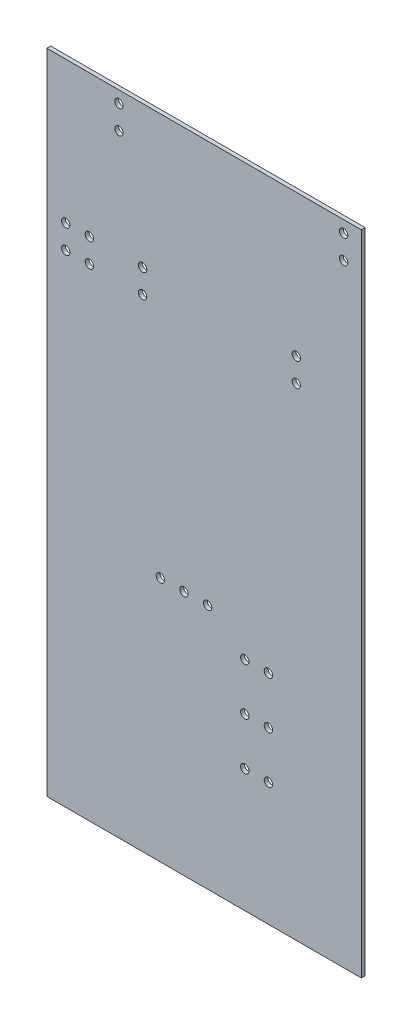
ISO-10303-21;
HEADER;
FILE_DESCRIPTION(('STEP AP214'),'2;1');
FILE_NAME('part.step','',(''),(''),'','','');
FILE_SCHEMA(('AUTOMOTIVE_DESIGN { 1 0 10303 214 1 1 1 1 }'));
ENDSEC;
DATA;
#1=APPLICATION_CONTEXT('core data for automotive mechanical design processes');
#2=APPLICATION_PROTOCOL_DEFINITION('international standard','automotive_design',2000,#1);
#3=PRODUCT_CONTEXT('',#1,'mechanical');
#4=PRODUCT('Part','Part','',(#3));
#5=PRODUCT_RELATED_PRODUCT_CATEGORY('part','',(#4));
#6=PRODUCT_DEFINITION_FORMATION('','',#4);
#7=PRODUCT_DEFINITION_CONTEXT('part definition',#1,'design');
#8=PRODUCT_DEFINITION('design','',#6,#7);
#9=PRODUCT_DEFINITION_SHAPE('','',#8);
#10=(LENGTH_UNIT() NAMED_UNIT(*) SI_UNIT(.MILLI.,.METRE.));
#11=(NAMED_UNIT(*) PLANE_ANGLE_UNIT() SI_UNIT($,.RADIAN.));
#12=(NAMED_UNIT(*) SI_UNIT($,.STERADIAN.) SOLID_ANGLE_UNIT());
#13=UNCERTAINTY_MEASURE_WITH_UNIT(LENGTH_MEASURE(1.E-05),#10,'distance_accuracy_value','');
#14=(GEOMETRIC_REPRESENTATION_CONTEXT(3) GLOBAL_UNCERTAINTY_ASSIGNED_CONTEXT((#13)) GLOBAL_UNIT_ASSIGNED_CONTEXT((#10,
#11,#12)) REPRESENTATION_CONTEXT('',''));
#15=CARTESIAN_POINT('',(0.,0.,0.));
#16=DIRECTION('',(0.,0.,1.));
#17=DIRECTION('',(1.,0.,0.));
#18=AXIS2_PLACEMENT_3D('',#15,#16,#17);
#19=CARTESIAN_POINT('',(114.807998657227,44.7039985656738,0.));
#20=DIRECTION('',(-1.,0.,0.));
#21=DIRECTION('',(0.,1.,0.));
#22=AXIS2_PLACEMENT_3D('',#19,#20,#21);
#23=PLANE('',#22);
#24=DIRECTION('',(0.,0.,1.));
#25=VECTOR('',#24,1.);
#26=CARTESIAN_POINT('',(114.807998657227,44.7039985656738,0.));
#27=LINE('',#26,#25);
#28=CARTESIAN_POINT('',(114.807998657227,44.7039985656738,0.));
#29=VERTEX_POINT('',#28);
#30=CARTESIAN_POINT('',(114.807998657227,44.7039985656738,0.41148));
#31=VERTEX_POINT('',#30);
#32=EDGE_CURVE('E11',#29,#31,#27,.T.);
#33=ORIENTED_EDGE('',*,*,#32,.T.);
#34=DIRECTION('',(0.,1.,0.));
#35=VECTOR('',#34,1.);
#36=CARTESIAN_POINT('',(114.807998657227,44.7039985656738,0.41148));
#37=LINE('',#36,#35);
#38=CARTESIAN_POINT('',(114.807998657227,114.300003051758,0.41148));
#39=VERTEX_POINT('',#38);
#40=EDGE_CURVE('E24',#31,#39,#37,.T.);
#41=ORIENTED_EDGE('',*,*,#40,.T.);
#42=DIRECTION('',(0.,0.,1.));
#43=VECTOR('',#42,1.);
#44=CARTESIAN_POINT('',(114.807998657227,114.300003051758,0.));
#45=LINE('',#44,#43);
#46=CARTESIAN_POINT('',(114.807998657227,114.300003051758,0.));
#47=VERTEX_POINT('',#46);
#48=EDGE_CURVE('E368',#47,#39,#45,.T.);
#49=ORIENTED_EDGE('',*,*,#48,.F.);
#50=DIRECTION('',(0.,1.,0.));
#51=VECTOR('',#50,1.);
#52=CARTESIAN_POINT('',(114.807998657227,44.7039985656738,0.));
#53=LINE('',#52,#51);
#54=EDGE_CURVE('E365',#29,#47,#53,.T.);
#55=ORIENTED_EDGE('',*,*,#54,.F.);
#56=EDGE_LOOP('',(#33,#41,#49,#55));
#57=FACE_BOUND('',#56,.T.);
#58=ADVANCED_FACE('F17',(#57),#23,.T.);
#59=CARTESIAN_POINT('',(114.807998657227,114.300003051758,0.));
#60=DIRECTION('',(0.,1.,0.));
#61=DIRECTION('',(1.,0.,0.));
#62=AXIS2_PLACEMENT_3D('',#59,#60,#61);
#63=PLANE('',#62);
#64=ORIENTED_EDGE('',*,*,#48,.T.);
#65=DIRECTION('',(1.,0.,0.));
#66=VECTOR('',#65,1.);
#67=CARTESIAN_POINT('',(114.807998657227,114.300003051758,0.41148));
#68=LINE('',#67,#66);
#69=CARTESIAN_POINT('',(148.589996337891,114.300003051758,0.41148));
#70=VERTEX_POINT('',#69);
#71=EDGE_CURVE('E362',#39,#70,#68,.T.);
#72=ORIENTED_EDGE('',*,*,#71,.T.);
#73=DIRECTION('',(0.,0.,1.));
#74=VECTOR('',#73,1.);
#75=CARTESIAN_POINT('',(148.589996337891,114.300003051758,0.));
#76=LINE('',#75,#74);
#77=CARTESIAN_POINT('',(148.589996337891,114.300003051758,0.));
#78=VERTEX_POINT('',#77);
#79=EDGE_CURVE('E360',#78,#70,#76,.T.);
#80=ORIENTED_EDGE('',*,*,#79,.F.);
#81=DIRECTION('',(1.,0.,0.));
#82=VECTOR('',#81,1.);
#83=CARTESIAN_POINT('',(114.807998657227,114.300003051758,0.));
#84=LINE('',#83,#82);
#85=EDGE_CURVE('E357',#47,#78,#84,.T.);
#86=ORIENTED_EDGE('',*,*,#85,.F.);
#87=EDGE_LOOP('',(#64,#72,#80,#86));
#88=FACE_BOUND('',#87,.T.);
#89=ADVANCED_FACE('F376',(#88),#63,.T.);
#90=CARTESIAN_POINT('',(148.589996337891,114.300003051758,0.));
#91=DIRECTION('',(1.,0.,0.));
#92=DIRECTION('',(0.,-1.,0.));
#93=AXIS2_PLACEMENT_3D('',#90,#91,#92);
#94=PLANE('',#93);
#95=ORIENTED_EDGE('',*,*,#79,.T.);
#96=DIRECTION('',(0.,-1.,0.));
#97=VECTOR('',#96,1.);
#98=CARTESIAN_POINT('',(148.589996337891,114.300003051758,0.41148));
#99=LINE('',#98,#97);
#100=CARTESIAN_POINT('',(148.589996337891,44.7039985656738,0.41148));
#101=VERTEX_POINT('',#100);
#102=EDGE_CURVE('E355',#70,#101,#99,.T.);
#103=ORIENTED_EDGE('',*,*,#102,.T.);
#104=DIRECTION('',(0.,0.,1.));
#105=VECTOR('',#104,1.);
#106=CARTESIAN_POINT('',(148.589996337891,44.7039985656738,0.));
#107=LINE('',#106,#105);
#108=CARTESIAN_POINT('',(148.589996337891,44.7039985656738,0.));
#109=VERTEX_POINT('',#108);
#110=EDGE_CURVE('E352',#109,#101,#107,.T.);
#111=ORIENTED_EDGE('',*,*,#110,.F.);
#112=DIRECTION('',(0.,-1.,0.));
#113=VECTOR('',#112,1.);
#114=CARTESIAN_POINT('',(148.589996337891,114.300003051758,0.));
#115=LINE('',#114,#113);
#116=EDGE_CURVE('E349',#78,#109,#115,.T.);
#117=ORIENTED_EDGE('',*,*,#116,.F.);
#118=EDGE_LOOP('',(#95,#103,#111,#117));
#119=FACE_BOUND('',#118,.T.);
#120=ADVANCED_FACE('F383',(#119),#94,.T.);
#121=CARTESIAN_POINT('',(148.589996337891,44.7039985656738,0.));
#122=DIRECTION('',(0.,-1.,0.));
#123=DIRECTION('',(-1.,0.,0.));
#124=AXIS2_PLACEMENT_3D('',#121,#122,#123);
#125=PLANE('',#124);
#126=ORIENTED_EDGE('',*,*,#110,.T.);
#127=DIRECTION('',(-1.,0.,0.));
#128=VECTOR('',#127,1.);
#129=CARTESIAN_POINT('',(148.589996337891,44.7039985656738,0.41148));
#130=LINE('',#129,#128);
#131=EDGE_CURVE('E347',#101,#31,#130,.T.);
#132=ORIENTED_EDGE('',*,*,#131,.T.);
#133=ORIENTED_EDGE('',*,*,#32,.F.);
#134=DIRECTION('',(-1.,0.,0.));
#135=VECTOR('',#134,1.);
#136=CARTESIAN_POINT('',(148.589996337891,44.7039985656738,0.));
#137=LINE('',#136,#135);
#138=EDGE_CURVE('E344',#109,#29,#137,.T.);
#139=ORIENTED_EDGE('',*,*,#138,.F.);
#140=EDGE_LOOP('',(#126,#132,#133,#139));
#141=FACE_BOUND('',#140,.T.);
#142=ADVANCED_FACE('F384',(#141),#125,.T.);
#143=CARTESIAN_POINT('',(119.38,96.52,0.));
#144=DIRECTION('',(0.,0.,-1.));
#145=DIRECTION('',(1.,0.,0.));
#146=AXIS2_PLACEMENT_3D('',#143,#144,#145);
#147=CYLINDRICAL_SURFACE('',#146,0.4499991);
#148=DIRECTION('',(0.,0.,1.));
#149=VECTOR('',#148,1.);
#150=CARTESIAN_POINT('',(119.8299991,96.52,0.));
#151=LINE('',#150,#149);
#152=CARTESIAN_POINT('',(119.8299991,96.52,0.));
#153=VERTEX_POINT('',#152);
#154=CARTESIAN_POINT('',(119.8299991,96.52,0.41148));
#155=VERTEX_POINT('',#154);
#156=EDGE_CURVE('E342',#153,#155,#151,.T.);
#157=ORIENTED_EDGE('',*,*,#156,.T.);
#158=CARTESIAN_POINT('',(119.38,96.52,0.41148));
#159=DIRECTION('',(0.,0.,1.));
#160=DIRECTION('',(1.,0.,0.));
#161=AXIS2_PLACEMENT_3D('',#158,#159,#160);
#162=CIRCLE('',#161,0.4499991);
#163=EDGE_CURVE('E339',#155,#155,#162,.T.);
#164=ORIENTED_EDGE('',*,*,#163,.T.);
#165=ORIENTED_EDGE('',*,*,#156,.F.);
#166=CARTESIAN_POINT('',(119.38,96.52,0.));
#167=DIRECTION('',(0.,0.,1.));
#168=DIRECTION('',(1.,0.,0.));
#169=AXIS2_PLACEMENT_3D('',#166,#167,#168);
#170=CIRCLE('',#169,0.4499991);
#171=EDGE_CURVE('E337',#153,#153,#170,.T.);
#172=ORIENTED_EDGE('',*,*,#171,.F.);
#173=EDGE_LOOP('',(#157,#164,#165,#172));
#174=FACE_BOUND('',#173,.T.);
#175=ADVANCED_FACE('F386',(#174),#147,.F.);
#176=CARTESIAN_POINT('',(116.84,99.06,0.));
#177=DIRECTION('',(0.,0.,-1.));
#178=DIRECTION('',(1.,0.,0.));
#179=AXIS2_PLACEMENT_3D('',#176,#177,#178);
#180=CYLINDRICAL_SURFACE('',#179,0.4499991);
#181=DIRECTION('',(0.,0.,1.));
#182=VECTOR('',#181,1.);
#183=CARTESIAN_POINT('',(117.2899991,99.06,0.));
#184=LINE('',#183,#182);
#185=CARTESIAN_POINT('',(117.2899991,99.06,0.));
#186=VERTEX_POINT('',#185);
#187=CARTESIAN_POINT('',(117.2899991,99.06,0.41148));
#188=VERTEX_POINT('',#187);
#189=EDGE_CURVE('E335',#186,#188,#184,.T.);
#190=ORIENTED_EDGE('',*,*,#189,.T.);
#191=CARTESIAN_POINT('',(116.84,99.06,0.41148));
#192=DIRECTION('',(0.,0.,1.));
#193=DIRECTION('',(1.,0.,0.));
#194=AXIS2_PLACEMENT_3D('',#191,#192,#193);
#195=CIRCLE('',#194,0.4499991);
#196=EDGE_CURVE('E332',#188,#188,#195,.T.);
#197=ORIENTED_EDGE('',*,*,#196,.T.);
#198=ORIENTED_EDGE('',*,*,#189,.F.);
#199=CARTESIAN_POINT('',(116.84,99.06,0.));
#200=DIRECTION('',(0.,0.,1.));
#201=DIRECTION('',(1.,0.,0.));
#202=AXIS2_PLACEMENT_3D('',#199,#200,#201);
#203=CIRCLE('',#202,0.4499991);
#204=EDGE_CURVE('E329',#186,#186,#203,.T.);
#205=ORIENTED_EDGE('',*,*,#204,.F.);
#206=EDGE_LOOP('',(#190,#197,#198,#205));
#207=FACE_BOUND('',#206,.T.);
#208=ADVANCED_FACE('F393',(#207),#180,.F.);
#209=CARTESIAN_POINT('',(116.84,96.52,0.));
#210=DIRECTION('',(0.,0.,-1.));
#211=DIRECTION('',(1.,0.,0.));
#212=AXIS2_PLACEMENT_3D('',#209,#210,#211);
#213=CYLINDRICAL_SURFACE('',#212,0.4499991);
#214=DIRECTION('',(0.,0.,1.));
#215=VECTOR('',#214,1.);
#216=CARTESIAN_POINT('',(117.2899991,96.52,0.));
#217=LINE('',#216,#215);
#218=CARTESIAN_POINT('',(117.2899991,96.52,0.));
#219=VERTEX_POINT('',#218);
#220=CARTESIAN_POINT('',(117.2899991,96.52,0.41148));
#221=VERTEX_POINT('',#220);
#222=EDGE_CURVE('E327',#219,#221,#217,.T.);
#223=ORIENTED_EDGE('',*,*,#222,.T.);
#224=CARTESIAN_POINT('',(116.84,96.52,0.41148));
#225=DIRECTION('',(0.,0.,1.));
#226=DIRECTION('',(1.,0.,0.));
#227=AXIS2_PLACEMENT_3D('',#224,#225,#226);
#228=CIRCLE('',#227,0.4499991);
#229=EDGE_CURVE('E324',#221,#221,#228,.T.);
#230=ORIENTED_EDGE('',*,*,#229,.T.);
#231=ORIENTED_EDGE('',*,*,#222,.F.);
#232=CARTESIAN_POINT('',(116.84,96.52,0.));
#233=DIRECTION('',(0.,0.,1.));
#234=DIRECTION('',(1.,0.,0.));
#235=AXIS2_PLACEMENT_3D('',#232,#233,#234);
#236=CIRCLE('',#235,0.4499991);
#237=EDGE_CURVE('E321',#219,#219,#236,.T.);
#238=ORIENTED_EDGE('',*,*,#237,.F.);
#239=EDGE_LOOP('',(#223,#230,#231,#238));
#240=FACE_BOUND('',#239,.T.);
#241=ADVANCED_FACE('F431',(#240),#213,.F.);
#242=CARTESIAN_POINT('',(119.38,99.06,0.));
#243=DIRECTION('',(0.,0.,-1.));
#244=DIRECTION('',(1.,0.,0.));
#245=AXIS2_PLACEMENT_3D('',#242,#243,#244);
#246=CYLINDRICAL_SURFACE('',#245,0.4499991);
#247=DIRECTION('',(0.,0.,1.));
#248=VECTOR('',#247,1.);
#249=CARTESIAN_POINT('',(119.8299991,99.06,0.));
#250=LINE('',#249,#248);
#251=CARTESIAN_POINT('',(119.8299991,99.06,0.));
#252=VERTEX_POINT('',#251);
#253=CARTESIAN_POINT('',(119.8299991,99.06,0.41148));
#254=VERTEX_POINT('',#253);
#255=EDGE_CURVE('E319',#252,#254,#250,.T.);
#256=ORIENTED_EDGE('',*,*,#255,.T.);
#257=CARTESIAN_POINT('',(119.38,99.06,0.41148));
#258=DIRECTION('',(0.,0.,1.));
#259=DIRECTION('',(1.,0.,0.));
#260=AXIS2_PLACEMENT_3D('',#257,#258,#259);
#261=CIRCLE('',#260,0.4499991);
#262=EDGE_CURVE('E316',#254,#254,#261,.T.);
#263=ORIENTED_EDGE('',*,*,#262,.T.);
#264=ORIENTED_EDGE('',*,*,#255,.F.);
#265=CARTESIAN_POINT('',(119.38,99.06,0.));
#266=DIRECTION('',(0.,0.,1.));
#267=DIRECTION('',(1.,0.,0.));
#268=AXIS2_PLACEMENT_3D('',#265,#266,#267);
#269=CIRCLE('',#268,0.4499991);
#270=EDGE_CURVE('E314',#252,#252,#269,.T.);
#271=ORIENTED_EDGE('',*,*,#270,.F.);
#272=EDGE_LOOP('',(#256,#263,#264,#271));
#273=FACE_BOUND('',#272,.T.);
#274=ADVANCED_FACE('F441',(#273),#246,.F.);
#275=CARTESIAN_POINT('',(125.095,96.52,0.));
#276=DIRECTION('',(0.,0.,-1.));
#277=DIRECTION('',(1.,0.,0.));
#278=AXIS2_PLACEMENT_3D('',#275,#276,#277);
#279=CYLINDRICAL_SURFACE('',#278,0.4499991);
#280=DIRECTION('',(0.,0.,1.));
#281=VECTOR('',#280,1.);
#282=CARTESIAN_POINT('',(125.5449991,96.52,0.));
#283=LINE('',#282,#281);
#284=CARTESIAN_POINT('',(125.5449991,96.52,0.));
#285=VERTEX_POINT('',#284);
#286=CARTESIAN_POINT('',(125.5449991,96.52,0.41148));
#287=VERTEX_POINT('',#286);
#288=EDGE_CURVE('E312',#285,#287,#283,.T.);
#289=ORIENTED_EDGE('',*,*,#288,.T.);
#290=CARTESIAN_POINT('',(125.095,96.52,0.41148));
#291=DIRECTION('',(0.,0.,1.));
#292=DIRECTION('',(1.,0.,0.));
#293=AXIS2_PLACEMENT_3D('',#290,#291,#292);
#294=CIRCLE('',#293,0.4499991);
#295=EDGE_CURVE('E309',#287,#287,#294,.T.);
#296=ORIENTED_EDGE('',*,*,#295,.T.);
#297=ORIENTED_EDGE('',*,*,#288,.F.);
#298=CARTESIAN_POINT('',(125.095,96.52,0.));
#299=DIRECTION('',(0.,0.,1.));
#300=DIRECTION('',(1.,0.,0.));
#301=AXIS2_PLACEMENT_3D('',#298,#299,#300);
#302=CIRCLE('',#301,0.4499991);
#303=EDGE_CURVE('E307',#285,#285,#302,.T.);
#304=ORIENTED_EDGE('',*,*,#303,.F.);
#305=EDGE_LOOP('',(#289,#296,#297,#304));
#306=FACE_BOUND('',#305,.T.);
#307=ADVANCED_FACE('F451',(#306),#279,.F.);
#308=CARTESIAN_POINT('',(122.555,113.03,0.));
#309=DIRECTION('',(0.,0.,-1.));
#310=DIRECTION('',(1.,0.,0.));
#311=AXIS2_PLACEMENT_3D('',#308,#309,#310);
#312=CYLINDRICAL_SURFACE('',#311,0.4499991);
#313=DIRECTION('',(0.,0.,1.));
#314=VECTOR('',#313,1.);
#315=CARTESIAN_POINT('',(123.0049991,113.03,0.));
#316=LINE('',#315,#314);
#317=CARTESIAN_POINT('',(123.0049991,113.03,0.));
#318=VERTEX_POINT('',#317);
#319=CARTESIAN_POINT('',(123.0049991,113.03,0.41148));
#320=VERTEX_POINT('',#319);
#321=EDGE_CURVE('E305',#318,#320,#316,.T.);
#322=ORIENTED_EDGE('',*,*,#321,.T.);
#323=CARTESIAN_POINT('',(122.555,113.03,0.41148));
#324=DIRECTION('',(0.,0.,1.));
#325=DIRECTION('',(1.,0.,0.));
#326=AXIS2_PLACEMENT_3D('',#323,#324,#325);
#327=CIRCLE('',#326,0.4499991);
#328=EDGE_CURVE('E302',#320,#320,#327,.T.);
#329=ORIENTED_EDGE('',*,*,#328,.T.);
#330=ORIENTED_EDGE('',*,*,#321,.F.);
#331=CARTESIAN_POINT('',(122.555,113.03,0.));
#332=DIRECTION('',(0.,0.,1.));
#333=DIRECTION('',(1.,0.,0.));
#334=AXIS2_PLACEMENT_3D('',#331,#332,#333);
#335=CIRCLE('',#334,0.4499991);
#336=EDGE_CURVE('E299',#318,#318,#335,.T.);
#337=ORIENTED_EDGE('',*,*,#336,.F.);
#338=EDGE_LOOP('',(#322,#329,#330,#337));
#339=FACE_BOUND('',#338,.T.);
#340=ADVANCED_FACE('F461',(#339),#312,.F.);
#341=CARTESIAN_POINT('',(122.555,110.49,0.));
#342=DIRECTION('',(0.,0.,-1.));
#343=DIRECTION('',(1.,0.,0.));
#344=AXIS2_PLACEMENT_3D('',#341,#342,#343);
#345=CYLINDRICAL_SURFACE('',#344,0.4499991);
#346=DIRECTION('',(0.,0.,1.));
#347=VECTOR('',#346,1.);
#348=CARTESIAN_POINT('',(123.0049991,110.49,0.));
#349=LINE('',#348,#347);
#350=CARTESIAN_POINT('',(123.0049991,110.49,0.));
#351=VERTEX_POINT('',#350);
#352=CARTESIAN_POINT('',(123.0049991,110.49,0.41148));
#353=VERTEX_POINT('',#352);
#354=EDGE_CURVE('E296',#351,#353,#349,.T.);
#355=ORIENTED_EDGE('',*,*,#354,.T.);
#356=CARTESIAN_POINT('',(122.555,110.49,0.41148));
#357=DIRECTION('',(0.,0.,1.));
#358=DIRECTION('',(1.,0.,0.));
#359=AXIS2_PLACEMENT_3D('',#356,#357,#358);
#360=CIRCLE('',#359,0.4499991);
#361=EDGE_CURVE('E294',#353,#353,#360,.T.);
#362=ORIENTED_EDGE('',*,*,#361,.T.);
#363=ORIENTED_EDGE('',*,*,#354,.F.);
#364=CARTESIAN_POINT('',(122.555,110.49,0.));
#365=DIRECTION('',(0.,0.,1.));
#366=DIRECTION('',(1.,0.,0.));
#367=AXIS2_PLACEMENT_3D('',#364,#365,#366);
#368=CIRCLE('',#367,0.4499991);
#369=EDGE_CURVE('E291',#351,#351,#368,.T.);
#370=ORIENTED_EDGE('',*,*,#369,.F.);
#371=EDGE_LOOP('',(#355,#362,#363,#370));
#372=FACE_BOUND('',#371,.T.);
#373=ADVANCED_FACE('F471',(#372),#345,.F.);
#374=CARTESIAN_POINT('',(136.0678,57.912,0.));
#375=DIRECTION('',(0.,0.,-1.));
#376=DIRECTION('',(1.,0.,0.));
#377=AXIS2_PLACEMENT_3D('',#374,#375,#376);
#378=CYLINDRICAL_SURFACE('',#377,0.4499991);
#379=DIRECTION('',(0.,0.,1.));
#380=VECTOR('',#379,1.);
#381=CARTESIAN_POINT('',(136.5177991,57.912,0.));
#382=LINE('',#381,#380);
#383=CARTESIAN_POINT('',(136.5177991,57.912,0.));
#384=VERTEX_POINT('',#383);
#385=CARTESIAN_POINT('',(136.5177991,57.912,0.41148));
#386=VERTEX_POINT('',#385);
#387=EDGE_CURVE('E289',#384,#386,#382,.T.);
#388=ORIENTED_EDGE('',*,*,#387,.T.);
#389=CARTESIAN_POINT('',(136.0678,57.912,0.41148));
#390=DIRECTION('',(0.,0.,1.));
#391=DIRECTION('',(1.,0.,0.));
#392=AXIS2_PLACEMENT_3D('',#389,#390,#391);
#393=CIRCLE('',#392,0.4499991);
#394=EDGE_CURVE('E286',#386,#386,#393,.T.);
#395=ORIENTED_EDGE('',*,*,#394,.T.);
#396=ORIENTED_EDGE('',*,*,#387,.F.);
#397=CARTESIAN_POINT('',(136.0678,57.912,0.));
#398=DIRECTION('',(0.,0.,1.));
#399=DIRECTION('',(1.,0.,0.));
#400=AXIS2_PLACEMENT_3D('',#397,#398,#399);
#401=CIRCLE('',#400,0.4499991);
#402=EDGE_CURVE('E283',#384,#384,#401,.T.);
#403=ORIENTED_EDGE('',*,*,#402,.F.);
#404=EDGE_LOOP('',(#388,#395,#396,#403));
#405=FACE_BOUND('',#404,.T.);
#406=ADVANCED_FACE('F481',(#405),#378,.F.);
#407=CARTESIAN_POINT('',(129.54,71.12,0.));
#408=DIRECTION('',(0.,0.,-1.));
#409=DIRECTION('',(1.,0.,0.));
#410=AXIS2_PLACEMENT_3D('',#407,#408,#409);
#411=CYLINDRICAL_SURFACE('',#410,0.4499991);
#412=DIRECTION('',(0.,0.,1.));
#413=VECTOR('',#412,1.);
#414=CARTESIAN_POINT('',(129.9899991,71.12,0.));
#415=LINE('',#414,#413);
#416=CARTESIAN_POINT('',(129.9899991,71.12,0.));
#417=VERTEX_POINT('',#416);
#418=CARTESIAN_POINT('',(129.9899991,71.12,0.41148));
#419=VERTEX_POINT('',#418);
#420=EDGE_CURVE('E280',#417,#419,#415,.T.);
#421=ORIENTED_EDGE('',*,*,#420,.T.);
#422=CARTESIAN_POINT('',(129.54,71.12,0.41148));
#423=DIRECTION('',(0.,0.,1.));
#424=DIRECTION('',(1.,0.,0.));
#425=AXIS2_PLACEMENT_3D('',#422,#423,#424);
#426=CIRCLE('',#425,0.4499991);
#427=EDGE_CURVE('E278',#419,#419,#426,.T.);
#428=ORIENTED_EDGE('',*,*,#427,.T.);
#429=ORIENTED_EDGE('',*,*,#420,.F.);
#430=CARTESIAN_POINT('',(129.54,71.12,0.));
#431=DIRECTION('',(0.,0.,1.));
#432=DIRECTION('',(1.,0.,0.));
#433=AXIS2_PLACEMENT_3D('',#430,#431,#432);
#434=CIRCLE('',#433,0.4499991);
#435=EDGE_CURVE('E276',#417,#417,#434,.T.);
#436=ORIENTED_EDGE('',*,*,#435,.F.);
#437=EDGE_LOOP('',(#421,#428,#429,#436));
#438=FACE_BOUND('',#437,.T.);
#439=ADVANCED_FACE('F491',(#438),#411,.F.);
#440=CARTESIAN_POINT('',(136.0678,62.992,0.));
#441=DIRECTION('',(0.,0.,-1.));
#442=DIRECTION('',(1.,0.,0.));
#443=AXIS2_PLACEMENT_3D('',#440,#441,#442);
#444=CYLINDRICAL_SURFACE('',#443,0.4499991);
#445=DIRECTION('',(0.,0.,1.));
#446=VECTOR('',#445,1.);
#447=CARTESIAN_POINT('',(136.5177991,62.992,0.));
#448=LINE('',#447,#446);
#449=CARTESIAN_POINT('',(136.5177991,62.992,0.));
#450=VERTEX_POINT('',#449);
#451=CARTESIAN_POINT('',(136.5177991,62.992,0.41148));
#452=VERTEX_POINT('',#451);
#453=EDGE_CURVE('E274',#450,#452,#448,.T.);
#454=ORIENTED_EDGE('',*,*,#453,.T.);
#455=CARTESIAN_POINT('',(136.0678,62.992,0.41148));
#456=DIRECTION('',(0.,0.,1.));
#457=DIRECTION('',(1.,0.,0.));
#458=AXIS2_PLACEMENT_3D('',#455,#456,#457);
#459=CIRCLE('',#458,0.4499991);
#460=EDGE_CURVE('E271',#452,#452,#459,.T.);
#461=ORIENTED_EDGE('',*,*,#460,.T.);
#462=ORIENTED_EDGE('',*,*,#453,.F.);
#463=CARTESIAN_POINT('',(136.0678,62.992,0.));
#464=DIRECTION('',(0.,0.,1.));
#465=DIRECTION('',(1.,0.,0.));
#466=AXIS2_PLACEMENT_3D('',#463,#464,#465);
#467=CIRCLE('',#466,0.4499991);
#468=EDGE_CURVE('E268',#450,#450,#467,.T.);
#469=ORIENTED_EDGE('',*,*,#468,.F.);
#470=EDGE_LOOP('',(#454,#461,#462,#469));
#471=FACE_BOUND('',#470,.T.);
#472=ADVANCED_FACE('F501',(#471),#444,.F.);
#473=CARTESIAN_POINT('',(138.6078,62.992,0.));
#474=DIRECTION('',(0.,0.,-1.));
#475=DIRECTION('',(1.,0.,0.));
#476=AXIS2_PLACEMENT_3D('',#473,#474,#475);
#477=CYLINDRICAL_SURFACE('',#476,0.4499991);
#478=DIRECTION('',(0.,0.,1.));
#479=VECTOR('',#478,1.);
#480=CARTESIAN_POINT('',(139.0577991,62.992,0.));
#481=LINE('',#480,#479);
#482=CARTESIAN_POINT('',(139.0577991,62.992,0.));
#483=VERTEX_POINT('',#482);
#484=CARTESIAN_POINT('',(139.0577991,62.992,0.41148));
#485=VERTEX_POINT('',#484);
#486=EDGE_CURVE('E266',#483,#485,#481,.T.);
#487=ORIENTED_EDGE('',*,*,#486,.T.);
#488=CARTESIAN_POINT('',(138.6078,62.992,0.41148));
#489=DIRECTION('',(0.,0.,1.));
#490=DIRECTION('',(1.,0.,0.));
#491=AXIS2_PLACEMENT_3D('',#488,#489,#490);
#492=CIRCLE('',#491,0.4499991);
#493=EDGE_CURVE('E263',#485,#485,#492,.T.);
#494=ORIENTED_EDGE('',*,*,#493,.T.);
#495=ORIENTED_EDGE('',*,*,#486,.F.);
#496=CARTESIAN_POINT('',(138.6078,62.992,0.));
#497=DIRECTION('',(0.,0.,1.));
#498=DIRECTION('',(1.,0.,0.));
#499=AXIS2_PLACEMENT_3D('',#496,#497,#498);
#500=CIRCLE('',#499,0.4499991);
#501=EDGE_CURVE('E261',#483,#483,#500,.T.);
#502=ORIENTED_EDGE('',*,*,#501,.F.);
#503=EDGE_LOOP('',(#487,#494,#495,#502));
#504=FACE_BOUND('',#503,.T.);
#505=ADVANCED_FACE('F511',(#504),#477,.F.);
#506=CARTESIAN_POINT('',(138.6078,57.912,0.));
#507=DIRECTION('',(0.,0.,-1.));
#508=DIRECTION('',(1.,0.,0.));
#509=AXIS2_PLACEMENT_3D('',#506,#507,#508);
#510=CYLINDRICAL_SURFACE('',#509,0.4499991);
#511=DIRECTION('',(0.,0.,1.));
#512=VECTOR('',#511,1.);
#513=CARTESIAN_POINT('',(139.0577991,57.912,0.));
#514=LINE('',#513,#512);
#515=CARTESIAN_POINT('',(139.0577991,57.912,0.));
#516=VERTEX_POINT('',#515);
#517=CARTESIAN_POINT('',(139.0577991,57.912,0.41148));
#518=VERTEX_POINT('',#517);
#519=EDGE_CURVE('E258',#516,#518,#514,.T.);
#520=ORIENTED_EDGE('',*,*,#519,.T.);
#521=CARTESIAN_POINT('',(138.6078,57.912,0.41148));
#522=DIRECTION('',(0.,0.,1.));
#523=DIRECTION('',(1.,0.,0.));
#524=AXIS2_PLACEMENT_3D('',#521,#522,#523);
#525=CIRCLE('',#524,0.4499991);
#526=EDGE_CURVE('E256',#518,#518,#525,.T.);
#527=ORIENTED_EDGE('',*,*,#526,.T.);
#528=ORIENTED_EDGE('',*,*,#519,.F.);
#529=CARTESIAN_POINT('',(138.6078,57.912,0.));
#530=DIRECTION('',(0.,0.,1.));
#531=DIRECTION('',(1.,0.,0.));
#532=AXIS2_PLACEMENT_3D('',#529,#530,#531);
#533=CIRCLE('',#532,0.4499991);
#534=EDGE_CURVE('E254',#516,#516,#533,.T.);
#535=ORIENTED_EDGE('',*,*,#534,.F.);
#536=EDGE_LOOP('',(#520,#527,#528,#535));
#537=FACE_BOUND('',#536,.T.);
#538=ADVANCED_FACE('F521',(#537),#510,.F.);
#539=CARTESIAN_POINT('',(136.0678,68.072,0.));
#540=DIRECTION('',(0.,0.,-1.));
#541=DIRECTION('',(1.,0.,0.));
#542=AXIS2_PLACEMENT_3D('',#539,#540,#541);
#543=CYLINDRICAL_SURFACE('',#542,0.4499991);
#544=DIRECTION('',(0.,0.,1.));
#545=VECTOR('',#544,1.);
#546=CARTESIAN_POINT('',(136.5177991,68.072,0.));
#547=LINE('',#546,#545);
#548=CARTESIAN_POINT('',(136.5177991,68.072,0.));
#549=VERTEX_POINT('',#548);
#550=CARTESIAN_POINT('',(136.5177991,68.072,0.41148));
#551=VERTEX_POINT('',#550);
#552=EDGE_CURVE('E252',#549,#551,#547,.T.);
#553=ORIENTED_EDGE('',*,*,#552,.T.);
#554=CARTESIAN_POINT('',(136.0678,68.072,0.41148));
#555=DIRECTION('',(0.,0.,1.));
#556=DIRECTION('',(1.,0.,0.));
#557=AXIS2_PLACEMENT_3D('',#554,#555,#556);
#558=CIRCLE('',#557,0.4499991);
#559=EDGE_CURVE('E249',#551,#551,#558,.T.);
#560=ORIENTED_EDGE('',*,*,#559,.T.);
#561=ORIENTED_EDGE('',*,*,#552,.F.);
#562=CARTESIAN_POINT('',(136.0678,68.072,0.));
#563=DIRECTION('',(0.,0.,1.));
#564=DIRECTION('',(1.,0.,0.));
#565=AXIS2_PLACEMENT_3D('',#562,#563,#564);
#566=CIRCLE('',#565,0.4499991);
#567=EDGE_CURVE('E246',#549,#549,#566,.T.);
#568=ORIENTED_EDGE('',*,*,#567,.F.);
#569=EDGE_LOOP('',(#553,#560,#561,#568));
#570=FACE_BOUND('',#569,.T.);
#571=ADVANCED_FACE('F531',(#570),#543,.F.);
#572=CARTESIAN_POINT('',(138.6078,68.072,0.));
#573=DIRECTION('',(0.,0.,-1.));
#574=DIRECTION('',(1.,0.,0.));
#575=AXIS2_PLACEMENT_3D('',#572,#573,#574);
#576=CYLINDRICAL_SURFACE('',#575,0.4499991);
#577=DIRECTION('',(0.,0.,1.));
#578=VECTOR('',#577,1.);
#579=CARTESIAN_POINT('',(139.0577991,68.072,0.));
#580=LINE('',#579,#578);
#581=CARTESIAN_POINT('',(139.0577991,68.072,0.));
#582=VERTEX_POINT('',#581);
#583=CARTESIAN_POINT('',(139.0577991,68.072,0.41148));
#584=VERTEX_POINT('',#583);
#585=EDGE_CURVE('E244',#582,#584,#580,.T.);
#586=ORIENTED_EDGE('',*,*,#585,.T.);
#587=CARTESIAN_POINT('',(138.6078,68.072,0.41148));
#588=DIRECTION('',(0.,0.,1.));
#589=DIRECTION('',(1.,0.,0.));
#590=AXIS2_PLACEMENT_3D('',#587,#588,#589);
#591=CIRCLE('',#590,0.4499991);
#592=EDGE_CURVE('E241',#584,#584,#591,.T.);
#593=ORIENTED_EDGE('',*,*,#592,.T.);
#594=ORIENTED_EDGE('',*,*,#585,.F.);
#595=CARTESIAN_POINT('',(138.6078,68.072,0.));
#596=DIRECTION('',(0.,0.,1.));
#597=DIRECTION('',(1.,0.,0.));
#598=AXIS2_PLACEMENT_3D('',#595,#596,#597);
#599=CIRCLE('',#598,0.4499991);
#600=EDGE_CURVE('E238',#582,#582,#599,.T.);
#601=ORIENTED_EDGE('',*,*,#600,.F.);
#602=EDGE_LOOP('',(#586,#593,#594,#601));
#603=FACE_BOUND('',#602,.T.);
#604=ADVANCED_FACE('F541',(#603),#576,.F.);
#605=CARTESIAN_POINT('',(132.08,71.12,0.));
#606=DIRECTION('',(0.,0.,-1.));
#607=DIRECTION('',(1.,0.,0.));
#608=AXIS2_PLACEMENT_3D('',#605,#606,#607);
#609=CYLINDRICAL_SURFACE('',#608,0.4499991);
#610=DIRECTION('',(0.,0.,1.));
#611=VECTOR('',#610,1.);
#612=CARTESIAN_POINT('',(132.5299991,71.12,0.));
#613=LINE('',#612,#611);
#614=CARTESIAN_POINT('',(132.5299991,71.12,0.));
#615=VERTEX_POINT('',#614);
#616=CARTESIAN_POINT('',(132.5299991,71.12,0.41148));
#617=VERTEX_POINT('',#616);
#618=EDGE_CURVE('E235',#615,#617,#613,.T.);
#619=ORIENTED_EDGE('',*,*,#618,.T.);
#620=CARTESIAN_POINT('',(132.08,71.12,0.41148));
#621=DIRECTION('',(0.,0.,1.));
#622=DIRECTION('',(1.,0.,0.));
#623=AXIS2_PLACEMENT_3D('',#620,#621,#622);
#624=CIRCLE('',#623,0.4499991);
#625=EDGE_CURVE('E233',#617,#617,#624,.T.);
#626=ORIENTED_EDGE('',*,*,#625,.T.);
#627=ORIENTED_EDGE('',*,*,#618,.F.);
#628=CARTESIAN_POINT('',(132.08,71.12,0.));
#629=DIRECTION('',(0.,0.,1.));
#630=DIRECTION('',(1.,0.,0.));
#631=AXIS2_PLACEMENT_3D('',#628,#629,#630);
#632=CIRCLE('',#631,0.4499991);
#633=EDGE_CURVE('E230',#615,#615,#632,.T.);
#634=ORIENTED_EDGE('',*,*,#633,.F.);
#635=EDGE_LOOP('',(#619,#626,#627,#634));
#636=FACE_BOUND('',#635,.T.);
#637=ADVANCED_FACE('F551',(#636),#609,.F.);
#638=CARTESIAN_POINT('',(125.095,99.06,0.));
#639=DIRECTION('',(0.,0.,-1.));
#640=DIRECTION('',(1.,0.,0.));
#641=AXIS2_PLACEMENT_3D('',#638,#639,#640);
#642=CYLINDRICAL_SURFACE('',#641,0.4499991);
#643=DIRECTION('',(0.,0.,1.));
#644=VECTOR('',#643,1.);
#645=CARTESIAN_POINT('',(125.5449991,99.06,0.));
#646=LINE('',#645,#644);
#647=CARTESIAN_POINT('',(125.5449991,99.06,0.));
#648=VERTEX_POINT('',#647);
#649=CARTESIAN_POINT('',(125.5449991,99.06,0.41148));
#650=VERTEX_POINT('',#649);
#651=EDGE_CURVE('E228',#648,#650,#646,.T.);
#652=ORIENTED_EDGE('',*,*,#651,.T.);
#653=CARTESIAN_POINT('',(125.095,99.06,0.41148));
#654=DIRECTION('',(0.,0.,1.));
#655=DIRECTION('',(1.,0.,0.));
#656=AXIS2_PLACEMENT_3D('',#653,#654,#655);
#657=CIRCLE('',#656,0.4499991);
#658=EDGE_CURVE('E225',#650,#650,#657,.T.);
#659=ORIENTED_EDGE('',*,*,#658,.T.);
#660=ORIENTED_EDGE('',*,*,#651,.F.);
#661=CARTESIAN_POINT('',(125.095,99.06,0.));
#662=DIRECTION('',(0.,0.,1.));
#663=DIRECTION('',(1.,0.,0.));
#664=AXIS2_PLACEMENT_3D('',#661,#662,#663);
#665=CIRCLE('',#664,0.4499991);
#666=EDGE_CURVE('E223',#648,#648,#665,.T.);
#667=ORIENTED_EDGE('',*,*,#666,.F.);
#668=EDGE_LOOP('',(#652,#659,#660,#667));
#669=FACE_BOUND('',#668,.T.);
#670=ADVANCED_FACE('F561',(#669),#642,.F.);
#671=CARTESIAN_POINT('',(127.,71.12,0.));
#672=DIRECTION('',(0.,0.,-1.));
#673=DIRECTION('',(1.,0.,0.));
#674=AXIS2_PLACEMENT_3D('',#671,#672,#673);
#675=CYLINDRICAL_SURFACE('',#674,0.4499991);
#676=DIRECTION('',(0.,0.,1.));
#677=VECTOR('',#676,1.);
#678=CARTESIAN_POINT('',(127.4499991,71.12,0.));
#679=LINE('',#678,#677);
#680=CARTESIAN_POINT('',(127.4499991,71.12,0.));
#681=VERTEX_POINT('',#680);
#682=CARTESIAN_POINT('',(127.4499991,71.12,0.41148));
#683=VERTEX_POINT('',#682);
#684=EDGE_CURVE('E221',#681,#683,#679,.T.);
#685=ORIENTED_EDGE('',*,*,#684,.T.);
#686=CARTESIAN_POINT('',(127.,71.12,0.41148));
#687=DIRECTION('',(0.,0.,1.));
#688=DIRECTION('',(1.,0.,0.));
#689=AXIS2_PLACEMENT_3D('',#686,#687,#688);
#690=CIRCLE('',#689,0.4499991);
#691=EDGE_CURVE('E218',#683,#683,#690,.T.);
#692=ORIENTED_EDGE('',*,*,#691,.T.);
#693=ORIENTED_EDGE('',*,*,#684,.F.);
#694=CARTESIAN_POINT('',(127.,71.12,0.));
#695=DIRECTION('',(0.,0.,1.));
#696=DIRECTION('',(1.,0.,0.));
#697=AXIS2_PLACEMENT_3D('',#694,#695,#696);
#698=CIRCLE('',#697,0.4499991);
#699=EDGE_CURVE('E215',#681,#681,#698,.T.);
#700=ORIENTED_EDGE('',*,*,#699,.F.);
#701=EDGE_LOOP('',(#685,#692,#693,#700));
#702=FACE_BOUND('',#701,.T.);
#703=ADVANCED_FACE('F571',(#702),#675,.F.);
#704=CARTESIAN_POINT('',(141.605,99.06,0.));
#705=DIRECTION('',(0.,0.,-1.));
#706=DIRECTION('',(1.,0.,0.));
#707=AXIS2_PLACEMENT_3D('',#704,#705,#706);
#708=CYLINDRICAL_SURFACE('',#707,0.4499991);
#709=DIRECTION('',(0.,0.,1.));
#710=VECTOR('',#709,1.);
#711=CARTESIAN_POINT('',(142.0549991,99.06,0.));
#712=LINE('',#711,#710);
#713=CARTESIAN_POINT('',(142.0549991,99.06,0.));
#714=VERTEX_POINT('',#713);
#715=CARTESIAN_POINT('',(142.0549991,99.06,0.41148));
#716=VERTEX_POINT('',#715);
#717=EDGE_CURVE('E212',#714,#716,#712,.T.);
#718=ORIENTED_EDGE('',*,*,#717,.T.);
#719=CARTESIAN_POINT('',(141.605,99.06,0.41148));
#720=DIRECTION('',(0.,0.,1.));
#721=DIRECTION('',(1.,0.,0.));
#722=AXIS2_PLACEMENT_3D('',#719,#720,#721);
#723=CIRCLE('',#722,0.4499991);
#724=EDGE_CURVE('E210',#716,#716,#723,.T.);
#725=ORIENTED_EDGE('',*,*,#724,.T.);
#726=ORIENTED_EDGE('',*,*,#717,.F.);
#727=CARTESIAN_POINT('',(141.605,99.06,0.));
#728=DIRECTION('',(0.,0.,1.));
#729=DIRECTION('',(1.,0.,0.));
#730=AXIS2_PLACEMENT_3D('',#727,#728,#729);
#731=CIRCLE('',#730,0.4499991);
#732=EDGE_CURVE('E207',#714,#714,#731,.T.);
#733=ORIENTED_EDGE('',*,*,#732,.F.);
#734=EDGE_LOOP('',(#718,#725,#726,#733));
#735=FACE_BOUND('',#734,.T.);
#736=ADVANCED_FACE('F581',(#735),#708,.F.);
#737=CARTESIAN_POINT('',(141.605,96.52,0.));
#738=DIRECTION('',(0.,0.,-1.));
#739=DIRECTION('',(1.,0.,0.));
#740=AXIS2_PLACEMENT_3D('',#737,#738,#739);
#741=CYLINDRICAL_SURFACE('',#740,0.4499991);
#742=DIRECTION('',(0.,0.,1.));
#743=VECTOR('',#742,1.);
#744=CARTESIAN_POINT('',(142.0549991,96.52,0.));
#745=LINE('',#744,#743);
#746=CARTESIAN_POINT('',(142.0549991,96.52,0.));
#747=VERTEX_POINT('',#746);
#748=CARTESIAN_POINT('',(142.0549991,96.52,0.41148));
#749=VERTEX_POINT('',#748);
#750=EDGE_CURVE('E205',#747,#749,#745,.T.);
#751=ORIENTED_EDGE('',*,*,#750,.T.);
#752=CARTESIAN_POINT('',(141.605,96.52,0.41148));
#753=DIRECTION('',(0.,0.,1.));
#754=DIRECTION('',(1.,0.,0.));
#755=AXIS2_PLACEMENT_3D('',#752,#753,#754);
#756=CIRCLE('',#755,0.4499991);
#757=EDGE_CURVE('E202',#749,#749,#756,.T.);
#758=ORIENTED_EDGE('',*,*,#757,.T.);
#759=ORIENTED_EDGE('',*,*,#750,.F.);
#760=CARTESIAN_POINT('',(141.605,96.52,0.));
#761=DIRECTION('',(0.,0.,1.));
#762=DIRECTION('',(1.,0.,0.));
#763=AXIS2_PLACEMENT_3D('',#760,#761,#762);
#764=CIRCLE('',#763,0.4499991);
#765=EDGE_CURVE('E199',#747,#747,#764,.T.);
#766=ORIENTED_EDGE('',*,*,#765,.F.);
#767=EDGE_LOOP('',(#751,#758,#759,#766));
#768=FACE_BOUND('',#767,.T.);
#769=ADVANCED_FACE('F591',(#768),#741,.F.);
#770=CARTESIAN_POINT('',(146.685,113.03,0.));
#771=DIRECTION('',(0.,0.,-1.));
#772=DIRECTION('',(1.,0.,0.));
#773=AXIS2_PLACEMENT_3D('',#770,#771,#772);
#774=CYLINDRICAL_SURFACE('',#773,0.4499991);
#775=DIRECTION('',(0.,0.,1.));
#776=VECTOR('',#775,1.);
#777=CARTESIAN_POINT('',(147.1349991,113.03,0.));
#778=LINE('',#777,#776);
#779=CARTESIAN_POINT('',(147.1349991,113.03,0.));
#780=VERTEX_POINT('',#779);
#781=CARTESIAN_POINT('',(147.1349991,113.03,0.41148));
#782=VERTEX_POINT('',#781);
#783=EDGE_CURVE('E196',#780,#782,#778,.T.);
#784=ORIENTED_EDGE('',*,*,#783,.T.);
#785=CARTESIAN_POINT('',(146.685,113.03,0.41148));
#786=DIRECTION('',(0.,0.,1.));
#787=DIRECTION('',(1.,0.,0.));
#788=AXIS2_PLACEMENT_3D('',#785,#786,#787);
#789=CIRCLE('',#788,0.4499991);
#790=EDGE_CURVE('E194',#782,#782,#789,.T.);
#791=ORIENTED_EDGE('',*,*,#790,.T.);
#792=ORIENTED_EDGE('',*,*,#783,.F.);
#793=CARTESIAN_POINT('',(146.685,113.03,0.));
#794=DIRECTION('',(0.,0.,1.));
#795=DIRECTION('',(1.,0.,0.));
#796=AXIS2_PLACEMENT_3D('',#793,#794,#795);
#797=CIRCLE('',#796,0.4499991);
#798=EDGE_CURVE('E186',#780,#780,#797,.T.);
#799=ORIENTED_EDGE('',*,*,#798,.F.);
#800=EDGE_LOOP('',(#784,#791,#792,#799));
#801=FACE_BOUND('',#800,.T.);
#802=ADVANCED_FACE('F601',(#801),#774,.F.);
#803=CARTESIAN_POINT('',(146.685,110.49,0.));
#804=DIRECTION('',(0.,0.,-1.));
#805=DIRECTION('',(1.,0.,0.));
#806=AXIS2_PLACEMENT_3D('',#803,#804,#805);
#807=CYLINDRICAL_SURFACE('',#806,0.4499991);
#808=DIRECTION('',(0.,0.,1.));
#809=VECTOR('',#808,1.);
#810=CARTESIAN_POINT('',(147.1349991,110.49,0.));
#811=LINE('',#810,#809);
#812=CARTESIAN_POINT('',(147.1349991,110.49,0.));
#813=VERTEX_POINT('',#812);
#814=CARTESIAN_POINT('',(147.1349991,110.49,0.41148));
#815=VERTEX_POINT('',#814);
#816=EDGE_CURVE('E180',#813,#815,#811,.T.);
#817=ORIENTED_EDGE('',*,*,#816,.T.);
#818=CARTESIAN_POINT('',(146.685,110.49,0.41148));
#819=DIRECTION('',(0.,0.,1.));
#820=DIRECTION('',(1.,0.,0.));
#821=AXIS2_PLACEMENT_3D('',#818,#819,#820);
#822=CIRCLE('',#821,0.4499991);
#823=EDGE_CURVE('E185',#815,#815,#822,.T.);
#824=ORIENTED_EDGE('',*,*,#823,.T.);
#825=ORIENTED_EDGE('',*,*,#816,.F.);
#826=CARTESIAN_POINT('',(146.685,110.49,0.));
#827=DIRECTION('',(0.,0.,1.));
#828=DIRECTION('',(1.,0.,0.));
#829=AXIS2_PLACEMENT_3D('',#826,#827,#828);
#830=CIRCLE('',#829,0.4499991);
#831=EDGE_CURVE('E183',#813,#813,#830,.T.);
#832=ORIENTED_EDGE('',*,*,#831,.F.);
#833=EDGE_LOOP('',(#817,#824,#825,#832));
#834=FACE_BOUND('',#833,.T.);
#835=ADVANCED_FACE('F182',(#834),#807,.F.);
#836=CARTESIAN_POINT('',(114.807998657227,44.7039985656738,0.));
#837=DIRECTION('',(0.,0.,1.));
#838=DIRECTION('',(1.,0.,0.));
#839=AXIS2_PLACEMENT_3D('',#836,#837,#838);
#840=PLANE('',#839);
#841=ORIENTED_EDGE('',*,*,#54,.T.);
#842=ORIENTED_EDGE('',*,*,#85,.T.);
#843=ORIENTED_EDGE('',*,*,#116,.T.);
#844=ORIENTED_EDGE('',*,*,#138,.T.);
#845=EDGE_LOOP('',(#841,#842,#843,#844));
#846=FACE_BOUND('',#845,.T.);
#847=ORIENTED_EDGE('',*,*,#171,.T.);
#848=EDGE_LOOP('',(#847));
#849=FACE_BOUND('',#848,.T.);
#850=ORIENTED_EDGE('',*,*,#204,.T.);
#851=EDGE_LOOP('',(#850));
#852=FACE_BOUND('',#851,.T.);
#853=ORIENTED_EDGE('',*,*,#237,.T.);
#854=EDGE_LOOP('',(#853));
#855=FACE_BOUND('',#854,.T.);
#856=ORIENTED_EDGE('',*,*,#270,.T.);
#857=EDGE_LOOP('',(#856));
#858=FACE_BOUND('',#857,.T.);
#859=ORIENTED_EDGE('',*,*,#303,.T.);
#860=EDGE_LOOP('',(#859));
#861=FACE_BOUND('',#860,.T.);
#862=ORIENTED_EDGE('',*,*,#336,.T.);
#863=EDGE_LOOP('',(#862));
#864=FACE_BOUND('',#863,.T.);
#865=ORIENTED_EDGE('',*,*,#369,.T.);
#866=EDGE_LOOP('',(#865));
#867=FACE_BOUND('',#866,.T.);
#868=ORIENTED_EDGE('',*,*,#402,.T.);
#869=EDGE_LOOP('',(#868));
#870=FACE_BOUND('',#869,.T.);
#871=ORIENTED_EDGE('',*,*,#435,.T.);
#872=EDGE_LOOP('',(#871));
#873=FACE_BOUND('',#872,.T.);
#874=ORIENTED_EDGE('',*,*,#468,.T.);
#875=EDGE_LOOP('',(#874));
#876=FACE_BOUND('',#875,.T.);
#877=ORIENTED_EDGE('',*,*,#501,.T.);
#878=EDGE_LOOP('',(#877));
#879=FACE_BOUND('',#878,.T.);
#880=ORIENTED_EDGE('',*,*,#534,.T.);
#881=EDGE_LOOP('',(#880));
#882=FACE_BOUND('',#881,.T.);
#883=ORIENTED_EDGE('',*,*,#567,.T.);
#884=EDGE_LOOP('',(#883));
#885=FACE_BOUND('',#884,.T.);
#886=ORIENTED_EDGE('',*,*,#600,.T.);
#887=EDGE_LOOP('',(#886));
#888=FACE_BOUND('',#887,.T.);
#889=ORIENTED_EDGE('',*,*,#633,.T.);
#890=EDGE_LOOP('',(#889));
#891=FACE_BOUND('',#890,.T.);
#892=ORIENTED_EDGE('',*,*,#666,.T.);
#893=EDGE_LOOP('',(#892));
#894=FACE_BOUND('',#893,.T.);
#895=ORIENTED_EDGE('',*,*,#699,.T.);
#896=EDGE_LOOP('',(#895));
#897=FACE_BOUND('',#896,.T.);
#898=ORIENTED_EDGE('',*,*,#732,.T.);
#899=EDGE_LOOP('',(#898));
#900=FACE_BOUND('',#899,.T.);
#901=ORIENTED_EDGE('',*,*,#765,.T.);
#902=EDGE_LOOP('',(#901));
#903=FACE_BOUND('',#902,.T.);
#904=ORIENTED_EDGE('',*,*,#798,.T.);
#905=EDGE_LOOP('',(#904));
#906=FACE_BOUND('',#905,.T.);
#907=ORIENTED_EDGE('',*,*,#831,.T.);
#908=EDGE_LOOP('',(#907));
#909=FACE_BOUND('',#908,.T.);
#910=ADVANCED_FACE('F189',(#846,#849,#852,#855,#858,#861,#864,#867,#870,#873,#876,#879,#882,
#885,#888,#891,#894,#897,#900,#903,#906,#909),#840,.F.);
#911=CARTESIAN_POINT('',(114.807998657227,44.7039985656738,0.41148));
#912=DIRECTION('',(0.,0.,1.));
#913=DIRECTION('',(1.,0.,0.));
#914=AXIS2_PLACEMENT_3D('',#911,#912,#913);
#915=PLANE('',#914);
#916=ORIENTED_EDGE('',*,*,#131,.F.);
#917=ORIENTED_EDGE('',*,*,#102,.F.);
#918=ORIENTED_EDGE('',*,*,#71,.F.);
#919=ORIENTED_EDGE('',*,*,#40,.F.);
#920=EDGE_LOOP('',(#916,#917,#918,#919));
#921=FACE_BOUND('',#920,.T.);
#922=ORIENTED_EDGE('',*,*,#163,.F.);
#923=EDGE_LOOP('',(#922));
#924=FACE_BOUND('',#923,.T.);
#925=ORIENTED_EDGE('',*,*,#196,.F.);
#926=EDGE_LOOP('',(#925));
#927=FACE_BOUND('',#926,.T.);
#928=ORIENTED_EDGE('',*,*,#229,.F.);
#929=EDGE_LOOP('',(#928));
#930=FACE_BOUND('',#929,.T.);
#931=ORIENTED_EDGE('',*,*,#262,.F.);
#932=EDGE_LOOP('',(#931));
#933=FACE_BOUND('',#932,.T.);
#934=ORIENTED_EDGE('',*,*,#295,.F.);
#935=EDGE_LOOP('',(#934));
#936=FACE_BOUND('',#935,.T.);
#937=ORIENTED_EDGE('',*,*,#328,.F.);
#938=EDGE_LOOP('',(#937));
#939=FACE_BOUND('',#938,.T.);
#940=ORIENTED_EDGE('',*,*,#361,.F.);
#941=EDGE_LOOP('',(#940));
#942=FACE_BOUND('',#941,.T.);
#943=ORIENTED_EDGE('',*,*,#394,.F.);
#944=EDGE_LOOP('',(#943));
#945=FACE_BOUND('',#944,.T.);
#946=ORIENTED_EDGE('',*,*,#427,.F.);
#947=EDGE_LOOP('',(#946));
#948=FACE_BOUND('',#947,.T.);
#949=ORIENTED_EDGE('',*,*,#460,.F.);
#950=EDGE_LOOP('',(#949));
#951=FACE_BOUND('',#950,.T.);
#952=ORIENTED_EDGE('',*,*,#493,.F.);
#953=EDGE_LOOP('',(#952));
#954=FACE_BOUND('',#953,.T.);
#955=ORIENTED_EDGE('',*,*,#526,.F.);
#956=EDGE_LOOP('',(#955));
#957=FACE_BOUND('',#956,.T.);
#958=ORIENTED_EDGE('',*,*,#559,.F.);
#959=EDGE_LOOP('',(#958));
#960=FACE_BOUND('',#959,.T.);
#961=ORIENTED_EDGE('',*,*,#592,.F.);
#962=EDGE_LOOP('',(#961));
#963=FACE_BOUND('',#962,.T.);
#964=ORIENTED_EDGE('',*,*,#625,.F.);
#965=EDGE_LOOP('',(#964));
#966=FACE_BOUND('',#965,.T.);
#967=ORIENTED_EDGE('',*,*,#658,.F.);
#968=EDGE_LOOP('',(#967));
#969=FACE_BOUND('',#968,.T.);
#970=ORIENTED_EDGE('',*,*,#691,.F.);
#971=EDGE_LOOP('',(#970));
#972=FACE_BOUND('',#971,.T.);
#973=ORIENTED_EDGE('',*,*,#724,.F.);
#974=EDGE_LOOP('',(#973));
#975=FACE_BOUND('',#974,.T.);
#976=ORIENTED_EDGE('',*,*,#757,.F.);
#977=EDGE_LOOP('',(#976));
#978=FACE_BOUND('',#977,.T.);
#979=ORIENTED_EDGE('',*,*,#790,.F.);
#980=EDGE_LOOP('',(#979));
#981=FACE_BOUND('',#980,.T.);
#982=ORIENTED_EDGE('',*,*,#823,.F.);
#983=EDGE_LOOP('',(#982));
#984=FACE_BOUND('',#983,.T.);
#985=ADVANCED_FACE('F373',(#921,#924,#927,#930,#933,#936,#939,#942,#945,#948,#951,#954,#957,
#960,#963,#966,#969,#972,#975,#978,#981,#984),#915,.T.);
#986=CLOSED_SHELL('',(#58,#89,#120,#142,#175,#208,#241,#274,#307,#340,#373,#406,#439,#472,#505,
#538,#571,#604,#637,#670,#703,#736,#769,#802,#835,#910,#985));
#987=MANIFOLD_SOLID_BREP('B1',#986);
#988=ADVANCED_BREP_SHAPE_REPRESENTATION('',(#18,#987),#14);
#989=SHAPE_DEFINITION_REPRESENTATION(#9,#988);
ENDSEC;
END-ISO-10303-21;
